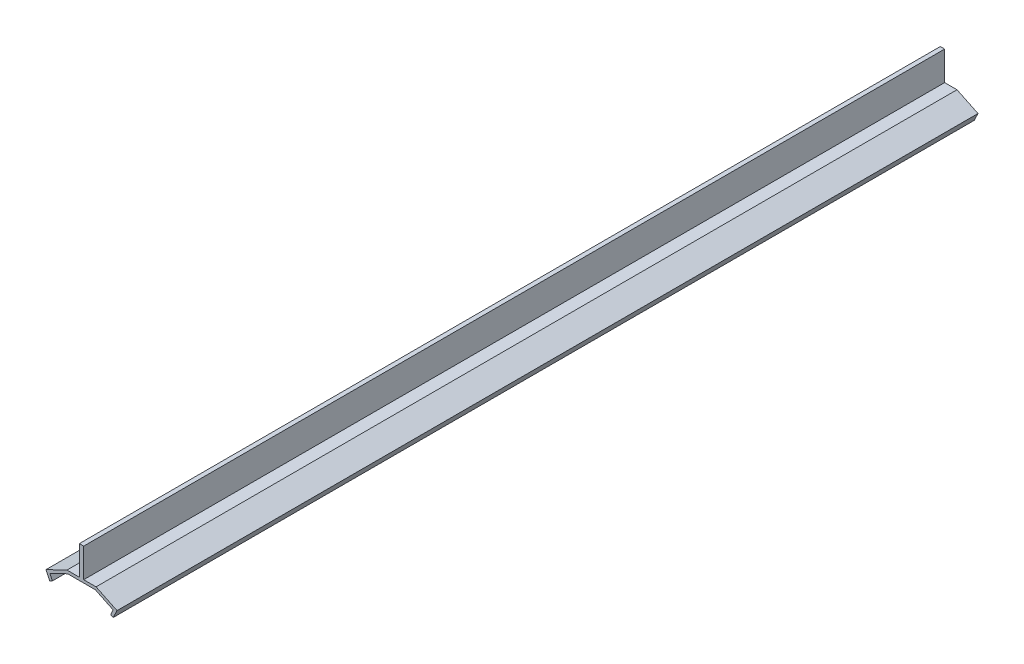
ISO-10303-21;
HEADER;
FILE_DESCRIPTION(('STEP AP214'),'2;1');
FILE_NAME('part.step','',(''),(''),'','','');
FILE_SCHEMA(('AUTOMOTIVE_DESIGN { 1 0 10303 214 1 1 1 1 }'));
ENDSEC;
DATA;
#1=APPLICATION_CONTEXT('core data for automotive mechanical design processes');
#2=APPLICATION_PROTOCOL_DEFINITION('international standard','automotive_design',2000,#1);
#3=PRODUCT_CONTEXT('',#1,'mechanical');
#4=PRODUCT('Part','Part','',(#3));
#5=PRODUCT_RELATED_PRODUCT_CATEGORY('part','',(#4));
#6=PRODUCT_DEFINITION_FORMATION('','',#4);
#7=PRODUCT_DEFINITION_CONTEXT('part definition',#1,'design');
#8=PRODUCT_DEFINITION('design','',#6,#7);
#9=PRODUCT_DEFINITION_SHAPE('','',#8);
#10=(LENGTH_UNIT() NAMED_UNIT(*) SI_UNIT(.MILLI.,.METRE.));
#11=(NAMED_UNIT(*) PLANE_ANGLE_UNIT() SI_UNIT($,.RADIAN.));
#12=(NAMED_UNIT(*) SI_UNIT($,.STERADIAN.) SOLID_ANGLE_UNIT());
#13=UNCERTAINTY_MEASURE_WITH_UNIT(LENGTH_MEASURE(1.E-05),#10,'distance_accuracy_value','');
#14=(GEOMETRIC_REPRESENTATION_CONTEXT(3) GLOBAL_UNCERTAINTY_ASSIGNED_CONTEXT((#13)) GLOBAL_UNIT_ASSIGNED_CONTEXT((#10,
#11,#12)) REPRESENTATION_CONTEXT('',''));
#15=CARTESIAN_POINT('',(0.,0.,0.));
#16=DIRECTION('',(0.,0.,1.));
#17=DIRECTION('',(1.,0.,0.));
#18=AXIS2_PLACEMENT_3D('',#15,#16,#17);
#19=CARTESIAN_POINT('',(-0.75,0.,148.));
#20=DIRECTION('',(0.,-1.,0.));
#21=DIRECTION('',(1.,0.,0.));
#22=AXIS2_PLACEMENT_3D('',#19,#20,#21);
#23=PLANE('',#22);
#24=DIRECTION('',(-1.,0.,0.));
#25=VECTOR('',#24,1.);
#26=CARTESIAN_POINT('',(-0.75,0.,-148.));
#27=LINE('',#26,#25);
#28=CARTESIAN_POINT('',(-0.75,0.,-148.));
#29=VERTEX_POINT('',#28);
#30=CARTESIAN_POINT('',(-5.,1.60064745075174E-13,-148.));
#31=VERTEX_POINT('',#30);
#32=EDGE_CURVE('E149',#29,#31,#27,.T.);
#33=ORIENTED_EDGE('',*,*,#32,.T.);
#34=DIRECTION('',(0.,0.,-1.));
#35=VECTOR('',#34,1.);
#36=CARTESIAN_POINT('',(-5.,1.60064745075174E-13,148.));
#37=LINE('',#36,#35);
#38=CARTESIAN_POINT('',(-5.,1.60064745075174E-13,148.));
#39=VERTEX_POINT('',#38);
#40=EDGE_CURVE('E11',#39,#31,#37,.T.);
#41=ORIENTED_EDGE('',*,*,#40,.F.);
#42=DIRECTION('',(-1.,0.,0.));
#43=VECTOR('',#42,1.);
#44=CARTESIAN_POINT('',(-0.75,0.,148.));
#45=LINE('',#44,#43);
#46=CARTESIAN_POINT('',(-0.75,0.,148.));
#47=VERTEX_POINT('',#46);
#48=EDGE_CURVE('E192',#47,#39,#45,.T.);
#49=ORIENTED_EDGE('',*,*,#48,.F.);
#50=DIRECTION('',(0.,0.,-1.));
#51=VECTOR('',#50,1.);
#52=CARTESIAN_POINT('',(-0.75,0.,148.));
#53=LINE('',#52,#51);
#54=EDGE_CURVE('E162',#47,#29,#53,.T.);
#55=ORIENTED_EDGE('',*,*,#54,.T.);
#56=EDGE_LOOP('',(#33,#41,#49,#55));
#57=FACE_BOUND('',#56,.T.);
#58=ADVANCED_FACE('F33',(#57),#23,.F.);
#59=CARTESIAN_POINT('',(-5.,1.60064745075174E-13,148.));
#60=DIRECTION('',(0.43396822123188,-0.900928178580756,0.));
#61=DIRECTION('',(0.900928178580756,0.43396822123188,0.));
#62=AXIS2_PLACEMENT_3D('',#59,#60,#61);
#63=PLANE('',#62);
#64=DIRECTION('',(-0.900928178580756,-0.43396822123188,0.));
#65=VECTOR('',#64,1.);
#66=CARTESIAN_POINT('',(-5.,1.60064745075174E-13,-148.));
#67=LINE('',#66,#65);
#68=CARTESIAN_POINT('',(-12.2074254286461,-3.47174576985491,-148.));
#69=VERTEX_POINT('',#68);
#70=EDGE_CURVE('E145',#31,#69,#67,.T.);
#71=ORIENTED_EDGE('',*,*,#70,.T.);
#72=DIRECTION('',(0.,0.,-1.));
#73=VECTOR('',#72,1.);
#74=CARTESIAN_POINT('',(-12.2074254286461,-3.47174576985491,148.));
#75=LINE('',#74,#73);
#76=CARTESIAN_POINT('',(-12.2074254286461,-3.47174576985491,148.));
#77=VERTEX_POINT('',#76);
#78=EDGE_CURVE('E40',#77,#69,#75,.T.);
#79=ORIENTED_EDGE('',*,*,#78,.F.);
#80=DIRECTION('',(-0.900928178580756,-0.43396822123188,0.));
#81=VECTOR('',#80,1.);
#82=CARTESIAN_POINT('',(-5.,1.60064745075174E-13,148.));
#83=LINE('',#82,#81);
#84=EDGE_CURVE('E158',#39,#77,#83,.T.);
#85=ORIENTED_EDGE('',*,*,#84,.F.);
#86=ORIENTED_EDGE('',*,*,#40,.T.);
#87=EDGE_LOOP('',(#71,#79,#85,#86));
#88=FACE_BOUND('',#87,.T.);
#89=ADVANCED_FACE('F157',(#88),#63,.F.);
#90=CARTESIAN_POINT('',(-12.2074254286461,-3.47174576985491,148.));
#91=DIRECTION('',(0.900928178580763,0.433968221231865,0.));
#92=DIRECTION('',(-0.433968221231865,0.900928178580763,0.));
#93=AXIS2_PLACEMENT_3D('',#90,#91,#92);
#94=PLANE('',#93);
#95=DIRECTION('',(0.433968221231865,-0.900928178580763,0.));
#96=VECTOR('',#95,1.);
#97=CARTESIAN_POINT('',(-12.2074254286461,-3.47174576985491,-148.));
#98=LINE('',#97,#96);
#99=CARTESIAN_POINT('',(-10.9055207649505,-6.17453030559719,-148.));
#100=VERTEX_POINT('',#99);
#101=EDGE_CURVE('E151',#69,#100,#98,.T.);
#102=ORIENTED_EDGE('',*,*,#101,.T.);
#103=DIRECTION('',(0.,0.,-1.));
#104=VECTOR('',#103,1.);
#105=CARTESIAN_POINT('',(-10.9055207649505,-6.17453030559719,148.));
#106=LINE('',#105,#104);
#107=CARTESIAN_POINT('',(-10.9055207649505,-6.17453030559719,148.));
#108=VERTEX_POINT('',#107);
#109=EDGE_CURVE('E258',#108,#100,#106,.T.);
#110=ORIENTED_EDGE('',*,*,#109,.F.);
#111=DIRECTION('',(0.433968221231865,-0.900928178580763,0.));
#112=VECTOR('',#111,1.);
#113=CARTESIAN_POINT('',(-12.2074254286461,-3.47174576985491,148.));
#114=LINE('',#113,#112);
#115=EDGE_CURVE('E195',#77,#108,#114,.T.);
#116=ORIENTED_EDGE('',*,*,#115,.F.);
#117=ORIENTED_EDGE('',*,*,#78,.T.);
#118=EDGE_LOOP('',(#102,#110,#116,#117));
#119=FACE_BOUND('',#118,.T.);
#120=ADVANCED_FACE('F262',(#119),#94,.F.);
#121=CARTESIAN_POINT('',(-10.0045925863698,-5.74056208436532,148.));
#122=DIRECTION('',(-0.433968221231862,0.900928178580764,0.));
#123=DIRECTION('',(-0.900928178580764,-0.433968221231862,0.));
#124=AXIS2_PLACEMENT_3D('',#121,#122,#123);
#125=PLANE('',#124);
#126=DIRECTION('',(0.900928178580764,0.433968221231862,0.));
#127=VECTOR('',#126,1.);
#128=CARTESIAN_POINT('',(-10.0045925863698,-5.74056208436532,-148.));
#129=LINE('',#128,#127);
#130=CARTESIAN_POINT('',(-10.0045925863698,-5.74056208436532,-148.));
#131=VERTEX_POINT('',#130);
#132=EDGE_CURVE('E166',#100,#131,#129,.T.);
#133=ORIENTED_EDGE('',*,*,#132,.T.);
#134=DIRECTION('',(0.,0.,-1.));
#135=VECTOR('',#134,1.);
#136=CARTESIAN_POINT('',(-10.0045925863698,-5.74056208436532,148.));
#137=LINE('',#136,#135);
#138=CARTESIAN_POINT('',(-10.0045925863698,-5.74056208436532,148.));
#139=VERTEX_POINT('',#138);
#140=EDGE_CURVE('E255',#139,#131,#137,.T.);
#141=ORIENTED_EDGE('',*,*,#140,.F.);
#142=DIRECTION('',(0.900928178580764,0.433968221231862,0.));
#143=VECTOR('',#142,1.);
#144=CARTESIAN_POINT('',(-10.0045925863698,-5.74056208436532,148.));
#145=LINE('',#144,#143);
#146=EDGE_CURVE('E197',#108,#139,#145,.T.);
#147=ORIENTED_EDGE('',*,*,#146,.F.);
#148=ORIENTED_EDGE('',*,*,#109,.T.);
#149=EDGE_LOOP('',(#133,#141,#147,#148));
#150=FACE_BOUND('',#149,.T.);
#151=ADVANCED_FACE('F270',(#150),#125,.F.);
#152=CARTESIAN_POINT('',(-10.8725290288336,-3.93870572720371,148.));
#153=DIRECTION('',(-0.900928178580759,-0.433968221231873,0.));
#154=DIRECTION('',(0.433968221231873,-0.900928178580759,0.));
#155=AXIS2_PLACEMENT_3D('',#152,#153,#154);
#156=PLANE('',#155);
#157=DIRECTION('',(-0.433968221231873,0.900928178580759,0.));
#158=VECTOR('',#157,1.);
#159=CARTESIAN_POINT('',(-10.8725290288336,-3.93870572720371,-148.));
#160=LINE('',#159,#158);
#161=CARTESIAN_POINT('',(-10.8725290288336,-3.93870572720371,-148.));
#162=VERTEX_POINT('',#161);
#163=EDGE_CURVE('E168',#131,#162,#160,.T.);
#164=ORIENTED_EDGE('',*,*,#163,.T.);
#165=DIRECTION('',(0.,0.,-1.));
#166=VECTOR('',#165,1.);
#167=CARTESIAN_POINT('',(-10.8725290288336,-3.93870572720371,148.));
#168=LINE('',#167,#166);
#169=CARTESIAN_POINT('',(-10.8725290288336,-3.93870572720371,148.));
#170=VERTEX_POINT('',#169);
#171=EDGE_CURVE('E252',#170,#162,#168,.T.);
#172=ORIENTED_EDGE('',*,*,#171,.F.);
#173=DIRECTION('',(-0.433968221231873,0.900928178580759,0.));
#174=VECTOR('',#173,1.);
#175=CARTESIAN_POINT('',(-10.8725290288336,-3.93870572720371,148.));
#176=LINE('',#175,#174);
#177=EDGE_CURVE('E199',#139,#170,#176,.T.);
#178=ORIENTED_EDGE('',*,*,#177,.F.);
#179=ORIENTED_EDGE('',*,*,#140,.T.);
#180=EDGE_LOOP('',(#164,#172,#178,#179));
#181=FACE_BOUND('',#180,.T.);
#182=ADVANCED_FACE('F273',(#181),#156,.F.);
#183=CARTESIAN_POINT('',(-10.8725290288336,-3.93870572720371,148.));
#184=DIRECTION('',(-0.433968221231861,0.900928178580765,0.));
#185=DIRECTION('',(-0.900928178580765,-0.433968221231861,0.));
#186=AXIS2_PLACEMENT_3D('',#183,#184,#185);
#187=PLANE('',#186);
#188=DIRECTION('',(0.900928178580765,0.433968221231861,0.));
#189=VECTOR('',#188,1.);
#190=CARTESIAN_POINT('',(-10.8725290288336,-3.93870572720371,-148.));
#191=LINE('',#190,#189);
#192=CARTESIAN_POINT('',(-4.7717071975038,-0.999999999999801,-148.));
#193=VERTEX_POINT('',#192);
#194=EDGE_CURVE('E170',#162,#193,#191,.T.);
#195=ORIENTED_EDGE('',*,*,#194,.T.);
#196=DIRECTION('',(0.,0.,-1.));
#197=VECTOR('',#196,1.);
#198=CARTESIAN_POINT('',(-4.7717071975038,-0.999999999999801,148.));
#199=LINE('',#198,#197);
#200=CARTESIAN_POINT('',(-4.7717071975038,-0.999999999999801,148.));
#201=VERTEX_POINT('',#200);
#202=EDGE_CURVE('E249',#201,#193,#199,.T.);
#203=ORIENTED_EDGE('',*,*,#202,.F.);
#204=DIRECTION('',(0.900928178580765,0.433968221231861,0.));
#205=VECTOR('',#204,1.);
#206=CARTESIAN_POINT('',(-10.8725290288336,-3.93870572720371,148.));
#207=LINE('',#206,#205);
#208=EDGE_CURVE('E201',#170,#201,#207,.T.);
#209=ORIENTED_EDGE('',*,*,#208,.F.);
#210=ORIENTED_EDGE('',*,*,#171,.T.);
#211=EDGE_LOOP('',(#195,#203,#209,#210));
#212=FACE_BOUND('',#211,.T.);
#213=ADVANCED_FACE('F278',(#212),#187,.F.);
#214=CARTESIAN_POINT('',(-4.7717071975038,-0.999999999999801,148.));
#215=DIRECTION('',(0.,1.,0.));
#216=DIRECTION('',(-1.,0.,0.));
#217=AXIS2_PLACEMENT_3D('',#214,#215,#216);
#218=PLANE('',#217);
#219=DIRECTION('',(1.,0.,0.));
#220=VECTOR('',#219,1.);
#221=CARTESIAN_POINT('',(-4.7717071975038,-0.999999999999801,-148.));
#222=LINE('',#221,#220);
#223=CARTESIAN_POINT('',(4.77170719750395,-1.,-148.));
#224=VERTEX_POINT('',#223);
#225=EDGE_CURVE('E172',#193,#224,#222,.T.);
#226=ORIENTED_EDGE('',*,*,#225,.T.);
#227=DIRECTION('',(0.,0.,-1.));
#228=VECTOR('',#227,1.);
#229=CARTESIAN_POINT('',(4.77170719750395,-1.,148.));
#230=LINE('',#229,#228);
#231=CARTESIAN_POINT('',(4.77170719750395,-1.,148.));
#232=VERTEX_POINT('',#231);
#233=EDGE_CURVE('E246',#232,#224,#230,.T.);
#234=ORIENTED_EDGE('',*,*,#233,.F.);
#235=DIRECTION('',(1.,0.,0.));
#236=VECTOR('',#235,1.);
#237=CARTESIAN_POINT('',(-4.7717071975038,-0.999999999999801,148.));
#238=LINE('',#237,#236);
#239=EDGE_CURVE('E203',#201,#232,#238,.T.);
#240=ORIENTED_EDGE('',*,*,#239,.F.);
#241=ORIENTED_EDGE('',*,*,#202,.T.);
#242=EDGE_LOOP('',(#226,#234,#240,#241));
#243=FACE_BOUND('',#242,.T.);
#244=ADVANCED_FACE('F284',(#243),#218,.F.);
#245=CARTESIAN_POINT('',(4.77170719750395,-1.,148.));
#246=DIRECTION('',(0.433968221231853,0.900928178580769,0.));
#247=DIRECTION('',(-0.900928178580769,0.433968221231853,0.));
#248=AXIS2_PLACEMENT_3D('',#245,#246,#247);
#249=PLANE('',#248);
#250=DIRECTION('',(0.900928178580769,-0.433968221231853,0.));
#251=VECTOR('',#250,1.);
#252=CARTESIAN_POINT('',(4.77170719750395,-1.,-148.));
#253=LINE('',#252,#251);
#254=CARTESIAN_POINT('',(10.8725290288334,-3.9387057272037,-148.));
#255=VERTEX_POINT('',#254);
#256=EDGE_CURVE('E174',#224,#255,#253,.T.);
#257=ORIENTED_EDGE('',*,*,#256,.T.);
#258=DIRECTION('',(0.,0.,-1.));
#259=VECTOR('',#258,1.);
#260=CARTESIAN_POINT('',(10.8725290288334,-3.9387057272037,148.));
#261=LINE('',#260,#259);
#262=CARTESIAN_POINT('',(10.8725290288334,-3.9387057272037,148.));
#263=VERTEX_POINT('',#262);
#264=EDGE_CURVE('E243',#263,#255,#261,.T.);
#265=ORIENTED_EDGE('',*,*,#264,.F.);
#266=DIRECTION('',(0.900928178580769,-0.433968221231853,0.));
#267=VECTOR('',#266,1.);
#268=CARTESIAN_POINT('',(4.77170719750395,-1.,148.));
#269=LINE('',#268,#267);
#270=EDGE_CURVE('E205',#232,#263,#269,.T.);
#271=ORIENTED_EDGE('',*,*,#270,.F.);
#272=ORIENTED_EDGE('',*,*,#233,.T.);
#273=EDGE_LOOP('',(#257,#265,#271,#272));
#274=FACE_BOUND('',#273,.T.);
#275=ADVANCED_FACE('F288',(#274),#249,.F.);
#276=CARTESIAN_POINT('',(10.8725290288334,-3.9387057272037,148.));
#277=DIRECTION('',(0.900928178580784,-0.433968221231822,0.));
#278=DIRECTION('',(0.433968221231822,0.900928178580784,0.));
#279=AXIS2_PLACEMENT_3D('',#276,#277,#278);
#280=PLANE('',#279);
#281=DIRECTION('',(-0.433968221231822,-0.900928178580784,0.));
#282=VECTOR('',#281,1.);
#283=CARTESIAN_POINT('',(10.8725290288334,-3.9387057272037,-148.));
#284=LINE('',#283,#282);
#285=CARTESIAN_POINT('',(10.0045925863698,-5.74056208436522,-148.));
#286=VERTEX_POINT('',#285);
#287=EDGE_CURVE('E176',#255,#286,#284,.T.);
#288=ORIENTED_EDGE('',*,*,#287,.T.);
#289=DIRECTION('',(0.,0.,-1.));
#290=VECTOR('',#289,1.);
#291=CARTESIAN_POINT('',(10.0045925863698,-5.74056208436522,148.));
#292=LINE('',#291,#290);
#293=CARTESIAN_POINT('',(10.0045925863698,-5.74056208436522,148.));
#294=VERTEX_POINT('',#293);
#295=EDGE_CURVE('E240',#294,#286,#292,.T.);
#296=ORIENTED_EDGE('',*,*,#295,.F.);
#297=DIRECTION('',(-0.433968221231822,-0.900928178580784,0.));
#298=VECTOR('',#297,1.);
#299=CARTESIAN_POINT('',(10.8725290288334,-3.9387057272037,148.));
#300=LINE('',#299,#298);
#301=EDGE_CURVE('E207',#263,#294,#300,.T.);
#302=ORIENTED_EDGE('',*,*,#301,.F.);
#303=ORIENTED_EDGE('',*,*,#264,.T.);
#304=EDGE_LOOP('',(#288,#296,#302,#303));
#305=FACE_BOUND('',#304,.T.);
#306=ADVANCED_FACE('F293',(#305),#280,.F.);
#307=CARTESIAN_POINT('',(10.0045925863698,-5.74056208436522,148.));
#308=DIRECTION('',(0.433968221232221,0.900928178580591,0.));
#309=DIRECTION('',(-0.900928178580591,0.433968221232221,0.));
#310=AXIS2_PLACEMENT_3D('',#307,#308,#309);
#311=PLANE('',#310);
#312=DIRECTION('',(0.900928178580591,-0.433968221232221,0.));
#313=VECTOR('',#312,1.);
#314=CARTESIAN_POINT('',(10.0045925863698,-5.74056208436522,-148.));
#315=LINE('',#314,#313);
#316=CARTESIAN_POINT('',(10.9055207649504,-6.17453030559744,-148.));
#317=VERTEX_POINT('',#316);
#318=EDGE_CURVE('E178',#286,#317,#315,.T.);
#319=ORIENTED_EDGE('',*,*,#318,.T.);
#320=DIRECTION('',(0.,0.,-1.));
#321=VECTOR('',#320,1.);
#322=CARTESIAN_POINT('',(10.9055207649504,-6.17453030559744,148.));
#323=LINE('',#322,#321);
#324=CARTESIAN_POINT('',(10.9055207649504,-6.17453030559744,148.));
#325=VERTEX_POINT('',#324);
#326=EDGE_CURVE('E237',#325,#317,#323,.T.);
#327=ORIENTED_EDGE('',*,*,#326,.F.);
#328=DIRECTION('',(0.900928178580591,-0.433968221232221,0.));
#329=VECTOR('',#328,1.);
#330=CARTESIAN_POINT('',(10.0045925863698,-5.74056208436522,148.));
#331=LINE('',#330,#329);
#332=EDGE_CURVE('E209',#294,#325,#331,.T.);
#333=ORIENTED_EDGE('',*,*,#332,.F.);
#334=ORIENTED_EDGE('',*,*,#295,.T.);
#335=EDGE_LOOP('',(#319,#327,#333,#334));
#336=FACE_BOUND('',#335,.T.);
#337=ADVANCED_FACE('F299',(#336),#311,.F.);
#338=CARTESIAN_POINT('',(10.9055207649504,-6.17453030559744,148.));
#339=DIRECTION('',(-0.900928178580778,0.433968221231834,0.));
#340=DIRECTION('',(-0.433968221231834,-0.900928178580778,0.));
#341=AXIS2_PLACEMENT_3D('',#338,#339,#340);
#342=PLANE('',#341);
#343=DIRECTION('',(0.433968221231834,0.900928178580778,0.));
#344=VECTOR('',#343,1.);
#345=CARTESIAN_POINT('',(10.9055207649504,-6.17453030559744,-148.));
#346=LINE('',#345,#344);
#347=CARTESIAN_POINT('',(12.2074254286461,-3.47174576985469,-148.));
#348=VERTEX_POINT('',#347);
#349=EDGE_CURVE('E180',#317,#348,#346,.T.);
#350=ORIENTED_EDGE('',*,*,#349,.T.);
#351=DIRECTION('',(0.,0.,-1.));
#352=VECTOR('',#351,1.);
#353=CARTESIAN_POINT('',(12.2074254286461,-3.47174576985469,148.));
#354=LINE('',#353,#352);
#355=CARTESIAN_POINT('',(12.2074254286461,-3.47174576985469,148.));
#356=VERTEX_POINT('',#355);
#357=EDGE_CURVE('E234',#356,#348,#354,.T.);
#358=ORIENTED_EDGE('',*,*,#357,.F.);
#359=DIRECTION('',(0.433968221231834,0.900928178580778,0.));
#360=VECTOR('',#359,1.);
#361=CARTESIAN_POINT('',(10.9055207649504,-6.17453030559744,148.));
#362=LINE('',#361,#360);
#363=EDGE_CURVE('E211',#325,#356,#362,.T.);
#364=ORIENTED_EDGE('',*,*,#363,.F.);
#365=ORIENTED_EDGE('',*,*,#326,.T.);
#366=EDGE_LOOP('',(#350,#358,#364,#365));
#367=FACE_BOUND('',#366,.T.);
#368=ADVANCED_FACE('F303',(#367),#342,.F.);
#369=CARTESIAN_POINT('',(12.2074254286461,-3.47174576985469,148.));
#370=DIRECTION('',(-0.433968221231857,-0.900928178580767,0.));
#371=DIRECTION('',(0.900928178580767,-0.433968221231857,0.));
#372=AXIS2_PLACEMENT_3D('',#369,#370,#371);
#373=PLANE('',#372);
#374=DIRECTION('',(-0.900928178580767,0.433968221231857,0.));
#375=VECTOR('',#374,1.);
#376=CARTESIAN_POINT('',(12.2074254286461,-3.47174576985469,-148.));
#377=LINE('',#376,#375);
#378=CARTESIAN_POINT('',(4.99999999999999,1.58227835544441E-13,-148.));
#379=VERTEX_POINT('',#378);
#380=EDGE_CURVE('E182',#348,#379,#377,.T.);
#381=ORIENTED_EDGE('',*,*,#380,.T.);
#382=DIRECTION('',(0.,0.,-1.));
#383=VECTOR('',#382,1.);
#384=CARTESIAN_POINT('',(4.99999999999999,1.58227835544441E-13,148.));
#385=LINE('',#384,#383);
#386=CARTESIAN_POINT('',(4.99999999999999,1.58227835544441E-13,148.));
#387=VERTEX_POINT('',#386);
#388=EDGE_CURVE('E231',#387,#379,#385,.T.);
#389=ORIENTED_EDGE('',*,*,#388,.F.);
#390=DIRECTION('',(-0.900928178580767,0.433968221231857,0.));
#391=VECTOR('',#390,1.);
#392=CARTESIAN_POINT('',(12.2074254286461,-3.47174576985469,148.));
#393=LINE('',#392,#391);
#394=EDGE_CURVE('E213',#356,#387,#393,.T.);
#395=ORIENTED_EDGE('',*,*,#394,.F.);
#396=ORIENTED_EDGE('',*,*,#357,.T.);
#397=EDGE_LOOP('',(#381,#389,#395,#396));
#398=FACE_BOUND('',#397,.T.);
#399=ADVANCED_FACE('F308',(#398),#373,.F.);
#400=CARTESIAN_POINT('',(4.99999999999999,1.58227835544441E-13,148.));
#401=DIRECTION('',(0.,-1.,0.));
#402=DIRECTION('',(1.,0.,0.));
#403=AXIS2_PLACEMENT_3D('',#400,#401,#402);
#404=PLANE('',#403);
#405=DIRECTION('',(-1.,0.,0.));
#406=VECTOR('',#405,1.);
#407=CARTESIAN_POINT('',(4.99999999999999,1.58227835544441E-13,-148.));
#408=LINE('',#407,#406);
#409=CARTESIAN_POINT('',(0.750000000000002,0.,-148.));
#410=VERTEX_POINT('',#409);
#411=EDGE_CURVE('E184',#379,#410,#408,.T.);
#412=ORIENTED_EDGE('',*,*,#411,.T.);
#413=DIRECTION('',(0.,0.,-1.));
#414=VECTOR('',#413,1.);
#415=CARTESIAN_POINT('',(0.750000000000002,0.,148.));
#416=LINE('',#415,#414);
#417=CARTESIAN_POINT('',(0.750000000000002,0.,148.));
#418=VERTEX_POINT('',#417);
#419=EDGE_CURVE('E228',#418,#410,#416,.T.);
#420=ORIENTED_EDGE('',*,*,#419,.F.);
#421=DIRECTION('',(-1.,0.,0.));
#422=VECTOR('',#421,1.);
#423=CARTESIAN_POINT('',(4.99999999999999,1.58227835544441E-13,148.));
#424=LINE('',#423,#422);
#425=EDGE_CURVE('E215',#387,#418,#424,.T.);
#426=ORIENTED_EDGE('',*,*,#425,.F.);
#427=ORIENTED_EDGE('',*,*,#388,.T.);
#428=EDGE_LOOP('',(#412,#420,#426,#427));
#429=FACE_BOUND('',#428,.T.);
#430=ADVANCED_FACE('F314',(#429),#404,.F.);
#431=CARTESIAN_POINT('',(0.75,10.,148.));
#432=DIRECTION('',(-1.,0.,0.));
#433=DIRECTION('',(0.,-1.,0.));
#434=AXIS2_PLACEMENT_3D('',#431,#432,#433);
#435=PLANE('',#434);
#436=DIRECTION('',(0.,1.,0.));
#437=VECTOR('',#436,1.);
#438=CARTESIAN_POINT('',(0.75,10.,-148.));
#439=LINE('',#438,#437);
#440=CARTESIAN_POINT('',(0.75,10.,-148.));
#441=VERTEX_POINT('',#440);
#442=EDGE_CURVE('E186',#410,#441,#439,.T.);
#443=ORIENTED_EDGE('',*,*,#442,.T.);
#444=DIRECTION('',(0.,0.,-1.));
#445=VECTOR('',#444,1.);
#446=CARTESIAN_POINT('',(0.75,10.,148.));
#447=LINE('',#446,#445);
#448=CARTESIAN_POINT('',(0.75,10.,148.));
#449=VERTEX_POINT('',#448);
#450=EDGE_CURVE('E225',#449,#441,#447,.T.);
#451=ORIENTED_EDGE('',*,*,#450,.F.);
#452=DIRECTION('',(0.,1.,0.));
#453=VECTOR('',#452,1.);
#454=CARTESIAN_POINT('',(0.75,10.,148.));
#455=LINE('',#454,#453);
#456=EDGE_CURVE('E217',#418,#449,#455,.T.);
#457=ORIENTED_EDGE('',*,*,#456,.F.);
#458=ORIENTED_EDGE('',*,*,#419,.T.);
#459=EDGE_LOOP('',(#443,#451,#457,#458));
#460=FACE_BOUND('',#459,.T.);
#461=ADVANCED_FACE('F318',(#460),#435,.F.);
#462=CARTESIAN_POINT('',(-0.75,10.,148.));
#463=DIRECTION('',(0.,-1.,0.));
#464=DIRECTION('',(0.,0.,-1.));
#465=AXIS2_PLACEMENT_3D('',#462,#463,#464);
#466=PLANE('',#465);
#467=DIRECTION('',(-1.,0.,0.));
#468=VECTOR('',#467,1.);
#469=CARTESIAN_POINT('',(-0.75,10.,-148.));
#470=LINE('',#469,#468);
#471=CARTESIAN_POINT('',(-0.75,10.,-148.));
#472=VERTEX_POINT('',#471);
#473=EDGE_CURVE('E188',#441,#472,#470,.T.);
#474=ORIENTED_EDGE('',*,*,#473,.T.);
#475=DIRECTION('',(0.,0.,-1.));
#476=VECTOR('',#475,1.);
#477=CARTESIAN_POINT('',(-0.75,10.,148.));
#478=LINE('',#477,#476);
#479=CARTESIAN_POINT('',(-0.75,10.,148.));
#480=VERTEX_POINT('',#479);
#481=EDGE_CURVE('E222',#480,#472,#478,.T.);
#482=ORIENTED_EDGE('',*,*,#481,.F.);
#483=DIRECTION('',(-1.,0.,0.));
#484=VECTOR('',#483,1.);
#485=CARTESIAN_POINT('',(-0.75,10.,148.));
#486=LINE('',#485,#484);
#487=EDGE_CURVE('E52',#449,#480,#486,.T.);
#488=ORIENTED_EDGE('',*,*,#487,.F.);
#489=ORIENTED_EDGE('',*,*,#450,.T.);
#490=EDGE_LOOP('',(#474,#482,#488,#489));
#491=FACE_BOUND('',#490,.T.);
#492=ADVANCED_FACE('F321',(#491),#466,.F.);
#493=CARTESIAN_POINT('',(-0.75,0.,148.));
#494=DIRECTION('',(1.,0.,0.));
#495=DIRECTION('',(0.,0.,-1.));
#496=AXIS2_PLACEMENT_3D('',#493,#494,#495);
#497=PLANE('',#496);
#498=DIRECTION('',(0.,-1.,0.));
#499=VECTOR('',#498,1.);
#500=CARTESIAN_POINT('',(-0.75,0.,-148.));
#501=LINE('',#500,#499);
#502=EDGE_CURVE('E190',#472,#29,#501,.T.);
#503=ORIENTED_EDGE('',*,*,#502,.T.);
#504=ORIENTED_EDGE('',*,*,#54,.F.);
#505=DIRECTION('',(0.,-1.,0.));
#506=VECTOR('',#505,1.);
#507=CARTESIAN_POINT('',(-0.75,0.,148.));
#508=LINE('',#507,#506);
#509=EDGE_CURVE('E47',#480,#47,#508,.T.);
#510=ORIENTED_EDGE('',*,*,#509,.F.);
#511=ORIENTED_EDGE('',*,*,#481,.T.);
#512=EDGE_LOOP('',(#503,#504,#510,#511));
#513=FACE_BOUND('',#512,.T.);
#514=ADVANCED_FACE('F323',(#513),#497,.F.);
#515=CARTESIAN_POINT('',(-0.75,0.,148.));
#516=DIRECTION('',(0.,0.,-1.));
#517=DIRECTION('',(-1.,0.,0.));
#518=AXIS2_PLACEMENT_3D('',#515,#516,#517);
#519=PLANE('',#518);
#520=ORIENTED_EDGE('',*,*,#48,.T.);
#521=ORIENTED_EDGE('',*,*,#84,.T.);
#522=ORIENTED_EDGE('',*,*,#115,.T.);
#523=ORIENTED_EDGE('',*,*,#146,.T.);
#524=ORIENTED_EDGE('',*,*,#177,.T.);
#525=ORIENTED_EDGE('',*,*,#208,.T.);
#526=ORIENTED_EDGE('',*,*,#239,.T.);
#527=ORIENTED_EDGE('',*,*,#270,.T.);
#528=ORIENTED_EDGE('',*,*,#301,.T.);
#529=ORIENTED_EDGE('',*,*,#332,.T.);
#530=ORIENTED_EDGE('',*,*,#363,.T.);
#531=ORIENTED_EDGE('',*,*,#394,.T.);
#532=ORIENTED_EDGE('',*,*,#425,.T.);
#533=ORIENTED_EDGE('',*,*,#456,.T.);
#534=ORIENTED_EDGE('',*,*,#487,.T.);
#535=ORIENTED_EDGE('',*,*,#509,.T.);
#536=EDGE_LOOP('',(#520,#521,#522,#523,#524,#525,#526,#527,#528,#529,#530,#531,#532,#533,#534,#535));
#537=FACE_BOUND('',#536,.T.);
#538=ADVANCED_FACE('F265',(#537),#519,.F.);
#539=CARTESIAN_POINT('',(-0.75,0.,-148.));
#540=DIRECTION('',(0.,0.,-1.));
#541=DIRECTION('',(-1.,0.,0.));
#542=AXIS2_PLACEMENT_3D('',#539,#540,#541);
#543=PLANE('',#542);
#544=ORIENTED_EDGE('',*,*,#32,.F.);
#545=ORIENTED_EDGE('',*,*,#502,.F.);
#546=ORIENTED_EDGE('',*,*,#473,.F.);
#547=ORIENTED_EDGE('',*,*,#442,.F.);
#548=ORIENTED_EDGE('',*,*,#411,.F.);
#549=ORIENTED_EDGE('',*,*,#380,.F.);
#550=ORIENTED_EDGE('',*,*,#349,.F.);
#551=ORIENTED_EDGE('',*,*,#318,.F.);
#552=ORIENTED_EDGE('',*,*,#287,.F.);
#553=ORIENTED_EDGE('',*,*,#256,.F.);
#554=ORIENTED_EDGE('',*,*,#225,.F.);
#555=ORIENTED_EDGE('',*,*,#194,.F.);
#556=ORIENTED_EDGE('',*,*,#163,.F.);
#557=ORIENTED_EDGE('',*,*,#132,.F.);
#558=ORIENTED_EDGE('',*,*,#101,.F.);
#559=ORIENTED_EDGE('',*,*,#70,.F.);
#560=EDGE_LOOP('',(#544,#545,#546,#547,#548,#549,#550,#551,#552,#553,#554,#555,#556,#557,#558,#559));
#561=FACE_BOUND('',#560,.T.);
#562=ADVANCED_FACE('F146',(#561),#543,.T.);
#563=CLOSED_SHELL('',(#58,#89,#120,#151,#182,#213,#244,#275,#306,#337,#368,#399,#430,#461,#492,
#514,#538,#562));
#564=MANIFOLD_SOLID_BREP('B2',#563);
#565=ADVANCED_BREP_SHAPE_REPRESENTATION('',(#18,#564),#14);
#566=SHAPE_DEFINITION_REPRESENTATION(#9,#565);
ENDSEC;
END-ISO-10303-21;
